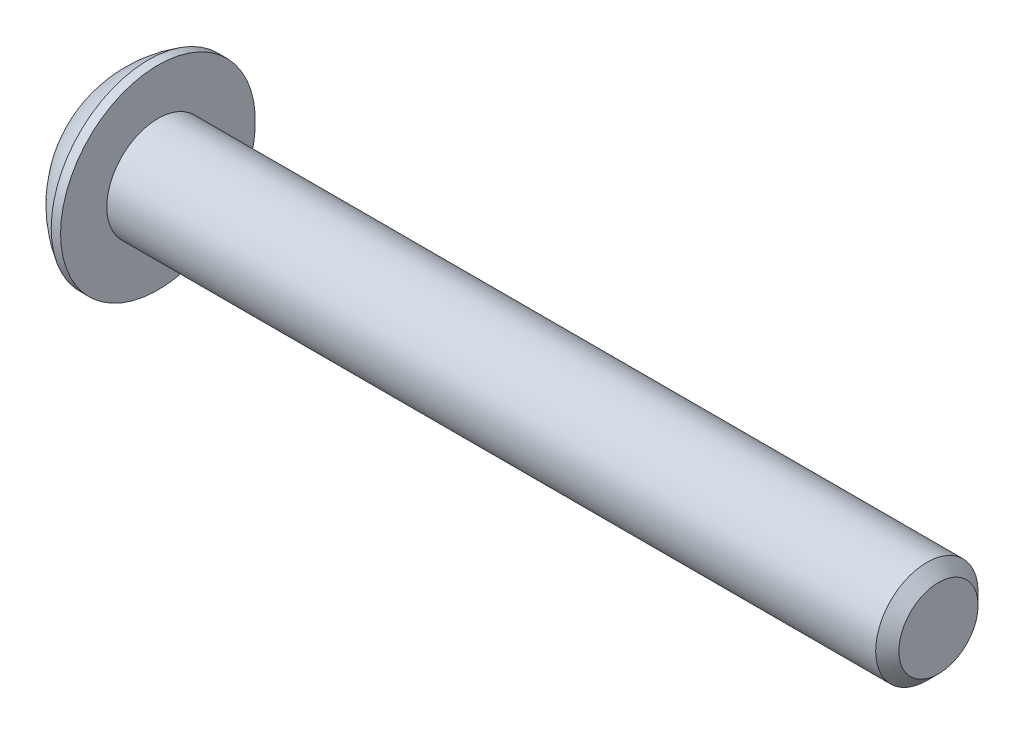
ISO-10303-21;
HEADER;
FILE_DESCRIPTION(('STEP AP214'),'2;1');
FILE_NAME('part.step','',(''),(''),'','','');
FILE_SCHEMA(('AUTOMOTIVE_DESIGN { 1 0 10303 214 1 1 1 1 }'));
ENDSEC;
DATA;
#1=APPLICATION_CONTEXT('core data for automotive mechanical design processes');
#2=APPLICATION_PROTOCOL_DEFINITION('international standard','automotive_design',2000,#1);
#3=PRODUCT_CONTEXT('',#1,'mechanical');
#4=PRODUCT('Part','Part','',(#3));
#5=PRODUCT_RELATED_PRODUCT_CATEGORY('part','',(#4));
#6=PRODUCT_DEFINITION_FORMATION('','',#4);
#7=PRODUCT_DEFINITION_CONTEXT('part definition',#1,'design');
#8=PRODUCT_DEFINITION('design','',#6,#7);
#9=PRODUCT_DEFINITION_SHAPE('','',#8);
#10=(LENGTH_UNIT() NAMED_UNIT(*) SI_UNIT(.MILLI.,.METRE.));
#11=(NAMED_UNIT(*) PLANE_ANGLE_UNIT() SI_UNIT($,.RADIAN.));
#12=(NAMED_UNIT(*) SI_UNIT($,.STERADIAN.) SOLID_ANGLE_UNIT());
#13=UNCERTAINTY_MEASURE_WITH_UNIT(LENGTH_MEASURE(1.E-05),#10,'distance_accuracy_value','');
#14=(GEOMETRIC_REPRESENTATION_CONTEXT(3) GLOBAL_UNCERTAINTY_ASSIGNED_CONTEXT((#13)) GLOBAL_UNIT_ASSIGNED_CONTEXT((#10,
#11,#12)) REPRESENTATION_CONTEXT('',''));
#15=CARTESIAN_POINT('',(0.,0.,0.));
#16=DIRECTION('',(0.,0.,1.));
#17=DIRECTION('',(1.,0.,0.));
#18=AXIS2_PLACEMENT_3D('',#15,#16,#17);
#19=CARTESIAN_POINT('',(1.32079999997359,0.,0.));
#20=DIRECTION('',(-1.,0.,0.));
#21=DIRECTION('',(0.,0.,1.));
#22=AXIS2_PLACEMENT_3D('',#19,#20,#21);
#23=CONICAL_SURFACE('',#22,1.19380000001001,1.04719755119008);
#24=CARTESIAN_POINT('',(2.0100407513155,0.,0.));
#25=VERTEX_POINT('',#24);
#26=VERTEX_LOOP('',#25);
#27=FACE_BOUND('',#26,.T.);
#28=CARTESIAN_POINT('',(1.32079999997359,0.,0.));
#29=DIRECTION('',(-1.,0.,0.));
#30=DIRECTION('',(0.,0.,1.));
#31=AXIS2_PLACEMENT_3D('',#28,#29,#30);
#32=CIRCLE('',#31,1.19380000001001);
#33=CARTESIAN_POINT('',(1.32079999998682,-1.0338611270422,0.596900000002503));
#34=VERTEX_POINT('',#33);
#35=CARTESIAN_POINT('',(1.32079999998682,0.,1.19380000000501));
#36=VERTEX_POINT('',#35);
#37=EDGE_CURVE('E92',#34,#36,#32,.T.);
#38=ORIENTED_EDGE('',*,*,#37,.T.);
#39=CARTESIAN_POINT('',(1.32079999997359,0.,0.));
#40=DIRECTION('',(-1.,0.,0.));
#41=DIRECTION('',(0.,0.,1.));
#42=AXIS2_PLACEMENT_3D('',#39,#40,#41);
#43=CIRCLE('',#42,1.19380000001001);
#44=CARTESIAN_POINT('',(1.32079999998682,1.0338611270422,0.596900000002504));
#45=VERTEX_POINT('',#44);
#46=EDGE_CURVE('E88',#36,#45,#43,.T.);
#47=ORIENTED_EDGE('',*,*,#46,.T.);
#48=CARTESIAN_POINT('',(1.32079999997359,0.,0.));
#49=DIRECTION('',(-1.,0.,0.));
#50=DIRECTION('',(0.,0.,1.));
#51=AXIS2_PLACEMENT_3D('',#48,#49,#50);
#52=CIRCLE('',#51,1.19380000001001);
#53=CARTESIAN_POINT('',(1.32079999998682,1.0338611270422,-0.596900000002504));
#54=VERTEX_POINT('',#53);
#55=EDGE_CURVE('E21',#45,#54,#52,.T.);
#56=ORIENTED_EDGE('',*,*,#55,.T.);
#57=CARTESIAN_POINT('',(1.32079999997359,0.,0.));
#58=DIRECTION('',(-1.,0.,0.));
#59=DIRECTION('',(0.,0.,1.));
#60=AXIS2_PLACEMENT_3D('',#57,#58,#59);
#61=CIRCLE('',#60,1.19380000001001);
#62=CARTESIAN_POINT('',(1.32079999998682,1.49461108489558E-12,-1.19380000000501));
#63=VERTEX_POINT('',#62);
#64=EDGE_CURVE('E151',#54,#63,#61,.T.);
#65=ORIENTED_EDGE('',*,*,#64,.T.);
#66=CARTESIAN_POINT('',(1.32079999997359,0.,0.));
#67=DIRECTION('',(-1.,0.,0.));
#68=DIRECTION('',(0.,0.,1.));
#69=AXIS2_PLACEMENT_3D('',#66,#67,#68);
#70=CIRCLE('',#69,1.19380000001001);
#71=CARTESIAN_POINT('',(1.32079999998682,-1.0338611270422,-0.596900000002503));
#72=VERTEX_POINT('',#71);
#73=EDGE_CURVE('E153',#63,#72,#70,.T.);
#74=ORIENTED_EDGE('',*,*,#73,.T.);
#75=CARTESIAN_POINT('',(1.32079999997359,0.,0.));
#76=DIRECTION('',(-1.,0.,0.));
#77=DIRECTION('',(0.,0.,1.));
#78=AXIS2_PLACEMENT_3D('',#75,#76,#77);
#79=CIRCLE('',#78,1.19380000001001);
#80=EDGE_CURVE('E155',#72,#34,#79,.T.);
#81=ORIENTED_EDGE('',*,*,#80,.T.);
#82=EDGE_LOOP('',(#38,#47,#56,#65,#74,#81));
#83=FACE_BOUND('',#82,.T.);
#84=ADVANCED_FACE('F17',(#27,#83),#23,.F.);
#85=CARTESIAN_POINT('',(1.3208,-2.06772225407572,-1.1938));
#86=DIRECTION('',(1.,0.,0.));
#87=DIRECTION('',(0.,0.,-1.));
#88=AXIS2_PLACEMENT_3D('',#85,#86,#87);
#89=PLANE('',#88);
#90=DIRECTION('',(0.,-0.5,-0.866025403784439));
#91=VECTOR('',#90,1.);
#92=CARTESIAN_POINT('',(1.32080000000004,1.37848150271715,0.));
#93=LINE('',#92,#91);
#94=CARTESIAN_POINT('',(1.32080000000001,1.37848150271715,0.));
#95=VERTEX_POINT('',#94);
#96=EDGE_CURVE('E104',#54,#95,#93,.F.);
#97=ORIENTED_EDGE('',*,*,#96,.F.);
#98=ORIENTED_EDGE('',*,*,#55,.F.);
#99=DIRECTION('',(0.,0.5,-0.866025403784439));
#100=VECTOR('',#99,1.);
#101=CARTESIAN_POINT('',(1.3208,0.689240751358576,1.1938));
#102=LINE('',#101,#100);
#103=EDGE_CURVE('E102',#95,#45,#102,.F.);
#104=ORIENTED_EDGE('',*,*,#103,.F.);
#105=EDGE_LOOP('',(#97,#98,#104));
#106=FACE_BOUND('',#105,.T.);
#107=ADVANCED_FACE('F100',(#106),#89,.F.);
#108=CARTESIAN_POINT('',(1.3208,-2.06772225407572,-1.1938));
#109=DIRECTION('',(1.,0.,0.));
#110=DIRECTION('',(0.,0.,-1.));
#111=AXIS2_PLACEMENT_3D('',#108,#109,#110);
#112=PLANE('',#111);
#113=DIRECTION('',(0.,0.5,-0.866025403784439));
#114=VECTOR('',#113,1.);
#115=CARTESIAN_POINT('',(1.32080000000004,0.689240751358576,1.1938));
#116=LINE('',#115,#114);
#117=CARTESIAN_POINT('',(1.32080000000001,0.689240751358576,1.1938));
#118=VERTEX_POINT('',#117);
#119=EDGE_CURVE('E106',#45,#118,#116,.F.);
#120=ORIENTED_EDGE('',*,*,#119,.F.);
#121=ORIENTED_EDGE('',*,*,#46,.F.);
#122=DIRECTION('',(0.,1.,0.));
#123=VECTOR('',#122,1.);
#124=CARTESIAN_POINT('',(1.3208,-0.689240751358574,1.1938));
#125=LINE('',#124,#123);
#126=EDGE_CURVE('E109',#118,#36,#125,.F.);
#127=ORIENTED_EDGE('',*,*,#126,.F.);
#128=EDGE_LOOP('',(#120,#121,#127));
#129=FACE_BOUND('',#128,.T.);
#130=ADVANCED_FACE('F107',(#129),#112,.F.);
#131=CARTESIAN_POINT('',(1.3208,-2.06772225407572,-1.1938));
#132=DIRECTION('',(1.,0.,0.));
#133=DIRECTION('',(0.,0.,-1.));
#134=AXIS2_PLACEMENT_3D('',#131,#132,#133);
#135=PLANE('',#134);
#136=DIRECTION('',(0.,1.,0.));
#137=VECTOR('',#136,1.);
#138=CARTESIAN_POINT('',(1.32080000000004,-0.689240751358574,1.1938));
#139=LINE('',#138,#137);
#140=CARTESIAN_POINT('',(1.32080000000001,-0.689240751358574,1.1938));
#141=VERTEX_POINT('',#140);
#142=EDGE_CURVE('E169',#36,#141,#139,.F.);
#143=ORIENTED_EDGE('',*,*,#142,.F.);
#144=ORIENTED_EDGE('',*,*,#37,.F.);
#145=DIRECTION('',(0.,0.5,0.866025403784439));
#146=VECTOR('',#145,1.);
#147=CARTESIAN_POINT('',(1.3208,-1.37848150271715,0.));
#148=LINE('',#147,#146);
#149=EDGE_CURVE('E167',#141,#34,#148,.F.);
#150=ORIENTED_EDGE('',*,*,#149,.F.);
#151=EDGE_LOOP('',(#143,#144,#150));
#152=FACE_BOUND('',#151,.T.);
#153=ADVANCED_FACE('F165',(#152),#135,.F.);
#154=CARTESIAN_POINT('',(1.3208,-2.06772225407572,-1.1938));
#155=DIRECTION('',(1.,0.,0.));
#156=DIRECTION('',(0.,0.,-1.));
#157=AXIS2_PLACEMENT_3D('',#154,#155,#156);
#158=PLANE('',#157);
#159=DIRECTION('',(0.,0.5,0.866025403784439));
#160=VECTOR('',#159,1.);
#161=CARTESIAN_POINT('',(1.32080000000004,-1.37848150271715,0.));
#162=LINE('',#161,#160);
#163=CARTESIAN_POINT('',(1.32080000000001,-1.37848150271715,0.));
#164=VERTEX_POINT('',#163);
#165=EDGE_CURVE('E170',#34,#164,#162,.F.);
#166=ORIENTED_EDGE('',*,*,#165,.F.);
#167=ORIENTED_EDGE('',*,*,#80,.F.);
#168=DIRECTION('',(0.,-0.5,0.866025403784439));
#169=VECTOR('',#168,1.);
#170=CARTESIAN_POINT('',(1.3208,-0.689240751358574,-1.1938));
#171=LINE('',#170,#169);
#172=EDGE_CURVE('E173',#164,#72,#171,.F.);
#173=ORIENTED_EDGE('',*,*,#172,.F.);
#174=EDGE_LOOP('',(#166,#167,#173));
#175=FACE_BOUND('',#174,.T.);
#176=ADVANCED_FACE('F171',(#175),#158,.F.);
#177=CARTESIAN_POINT('',(1.3208,-2.06772225407572,-1.1938));
#178=DIRECTION('',(1.,0.,0.));
#179=DIRECTION('',(0.,0.,-1.));
#180=AXIS2_PLACEMENT_3D('',#177,#178,#179);
#181=PLANE('',#180);
#182=DIRECTION('',(0.,-0.5,0.866025403784439));
#183=VECTOR('',#182,1.);
#184=CARTESIAN_POINT('',(1.32080000000004,-0.689240751358574,-1.1938));
#185=LINE('',#184,#183);
#186=CARTESIAN_POINT('',(1.32080000000001,-0.689240751358574,-1.1938));
#187=VERTEX_POINT('',#186);
#188=EDGE_CURVE('E228',#72,#187,#185,.F.);
#189=ORIENTED_EDGE('',*,*,#188,.F.);
#190=ORIENTED_EDGE('',*,*,#73,.F.);
#191=DIRECTION('',(0.,1.,0.));
#192=VECTOR('',#191,1.);
#193=CARTESIAN_POINT('',(1.3208,0.689240751358577,-1.1938));
#194=LINE('',#193,#192);
#195=EDGE_CURVE('E240',#187,#63,#194,.T.);
#196=ORIENTED_EDGE('',*,*,#195,.F.);
#197=EDGE_LOOP('',(#189,#190,#196));
#198=FACE_BOUND('',#197,.T.);
#199=ADVANCED_FACE('F390',(#198),#181,.F.);
#200=CARTESIAN_POINT('',(1.3208,-2.06772225407572,-1.1938));
#201=DIRECTION('',(1.,0.,0.));
#202=DIRECTION('',(0.,0.,-1.));
#203=AXIS2_PLACEMENT_3D('',#200,#201,#202);
#204=PLANE('',#203);
#205=DIRECTION('',(0.,1.,0.));
#206=VECTOR('',#205,1.);
#207=CARTESIAN_POINT('',(1.32080000000004,0.689240751358577,-1.1938));
#208=LINE('',#207,#206);
#209=CARTESIAN_POINT('',(1.32080000000002,0.689240751358565,-1.19380000000002));
#210=VERTEX_POINT('',#209);
#211=EDGE_CURVE('E248',#63,#210,#208,.T.);
#212=ORIENTED_EDGE('',*,*,#211,.F.);
#213=ORIENTED_EDGE('',*,*,#64,.F.);
#214=DIRECTION('',(0.,-0.5,-0.866025403784439));
#215=VECTOR('',#214,1.);
#216=CARTESIAN_POINT('',(1.3208,1.37848150271715,0.));
#217=LINE('',#216,#215);
#218=EDGE_CURVE('E128',#210,#54,#217,.F.);
#219=ORIENTED_EDGE('',*,*,#218,.F.);
#220=EDGE_LOOP('',(#212,#213,#219));
#221=FACE_BOUND('',#220,.T.);
#222=ADVANCED_FACE('F380',(#221),#204,.F.);
#223=CARTESIAN_POINT('',(1.3208,1.37848150271715,0.));
#224=DIRECTION('',(0.,-0.866025403784439,0.5));
#225=DIRECTION('',(0.,-0.5,-0.866025403784439));
#226=AXIS2_PLACEMENT_3D('',#223,#224,#225);
#227=PLANE('',#226);
#228=ORIENTED_EDGE('',*,*,#96,.T.);
#229=DIRECTION('',(1.,0.,0.));
#230=VECTOR('',#229,1.);
#231=CARTESIAN_POINT('',(1.3208,1.37848150271715,0.));
#232=LINE('',#231,#230);
#233=CARTESIAN_POINT('',(0.,1.37848150271715,0.));
#234=VERTEX_POINT('',#233);
#235=EDGE_CURVE('E116',#234,#95,#232,.T.);
#236=ORIENTED_EDGE('',*,*,#235,.F.);
#237=DIRECTION('',(0.,0.5,0.866025403784439));
#238=VECTOR('',#237,1.);
#239=CARTESIAN_POINT('',(0.,0.689240751358577,-1.1938));
#240=LINE('',#239,#238);
#241=CARTESIAN_POINT('',(0.,0.689240751358577,-1.1938));
#242=VERTEX_POINT('',#241);
#243=EDGE_CURVE('E131',#242,#234,#240,.T.);
#244=ORIENTED_EDGE('',*,*,#243,.F.);
#245=DIRECTION('',(1.,0.,0.));
#246=VECTOR('',#245,1.);
#247=CARTESIAN_POINT('',(1.3208,0.689240751358577,-1.1938));
#248=LINE('',#247,#246);
#249=EDGE_CURVE('E135',#210,#242,#248,.F.);
#250=ORIENTED_EDGE('',*,*,#249,.F.);
#251=ORIENTED_EDGE('',*,*,#218,.T.);
#252=EDGE_LOOP('',(#228,#236,#244,#250,#251));
#253=FACE_BOUND('',#252,.T.);
#254=ADVANCED_FACE('F371',(#253),#227,.T.);
#255=CARTESIAN_POINT('',(1.3208,0.689240751358576,1.1938));
#256=DIRECTION('',(0.,-0.866025403784439,-0.5));
#257=DIRECTION('',(0.,0.5,-0.866025403784439));
#258=AXIS2_PLACEMENT_3D('',#255,#256,#257);
#259=PLANE('',#258);
#260=ORIENTED_EDGE('',*,*,#119,.T.);
#261=DIRECTION('',(1.,0.,0.));
#262=VECTOR('',#261,1.);
#263=CARTESIAN_POINT('',(1.3208,0.689240751358576,1.1938));
#264=LINE('',#263,#262);
#265=CARTESIAN_POINT('',(0.,0.689240751358577,1.1938));
#266=VERTEX_POINT('',#265);
#267=EDGE_CURVE('E112',#266,#118,#264,.T.);
#268=ORIENTED_EDGE('',*,*,#267,.F.);
#269=DIRECTION('',(0.,-0.5,0.866025403784439));
#270=VECTOR('',#269,1.);
#271=CARTESIAN_POINT('',(0.,1.37848150271715,0.));
#272=LINE('',#271,#270);
#273=EDGE_CURVE('E134',#234,#266,#272,.T.);
#274=ORIENTED_EDGE('',*,*,#273,.F.);
#275=ORIENTED_EDGE('',*,*,#235,.T.);
#276=ORIENTED_EDGE('',*,*,#103,.T.);
#277=EDGE_LOOP('',(#260,#268,#274,#275,#276));
#278=FACE_BOUND('',#277,.T.);
#279=ADVANCED_FACE('F114',(#278),#259,.T.);
#280=CARTESIAN_POINT('',(1.3208,-0.689240751358574,1.1938));
#281=DIRECTION('',(0.,0.,-1.));
#282=DIRECTION('',(0.,1.,0.));
#283=AXIS2_PLACEMENT_3D('',#280,#281,#282);
#284=PLANE('',#283);
#285=ORIENTED_EDGE('',*,*,#142,.T.);
#286=DIRECTION('',(1.,0.,0.));
#287=VECTOR('',#286,1.);
#288=CARTESIAN_POINT('',(1.3208,-0.689240751358574,1.1938));
#289=LINE('',#288,#287);
#290=CARTESIAN_POINT('',(0.,-0.689240751358574,1.1938));
#291=VERTEX_POINT('',#290);
#292=EDGE_CURVE('E180',#291,#141,#289,.T.);
#293=ORIENTED_EDGE('',*,*,#292,.F.);
#294=DIRECTION('',(0.,1.,0.));
#295=VECTOR('',#294,1.);
#296=CARTESIAN_POINT('',(0.,0.,1.1938));
#297=LINE('',#296,#295);
#298=EDGE_CURVE('E194',#266,#291,#297,.F.);
#299=ORIENTED_EDGE('',*,*,#298,.F.);
#300=ORIENTED_EDGE('',*,*,#267,.T.);
#301=ORIENTED_EDGE('',*,*,#126,.T.);
#302=EDGE_LOOP('',(#285,#293,#299,#300,#301));
#303=FACE_BOUND('',#302,.T.);
#304=ADVANCED_FACE('F216',(#303),#284,.T.);
#305=CARTESIAN_POINT('',(1.3208,-1.37848150271715,0.));
#306=DIRECTION('',(0.,0.866025403784439,-0.5));
#307=DIRECTION('',(0.,0.5,0.866025403784439));
#308=AXIS2_PLACEMENT_3D('',#305,#306,#307);
#309=PLANE('',#308);
#310=ORIENTED_EDGE('',*,*,#165,.T.);
#311=DIRECTION('',(1.,0.,0.));
#312=VECTOR('',#311,1.);
#313=CARTESIAN_POINT('',(1.3208,-1.37848150271715,0.));
#314=LINE('',#313,#312);
#315=CARTESIAN_POINT('',(0.,-1.37848150271715,0.));
#316=VERTEX_POINT('',#315);
#317=EDGE_CURVE('E176',#316,#164,#314,.T.);
#318=ORIENTED_EDGE('',*,*,#317,.F.);
#319=DIRECTION('',(0.,-0.5,-0.866025403784439));
#320=VECTOR('',#319,1.);
#321=CARTESIAN_POINT('',(0.,-0.689240751358574,1.1938));
#322=LINE('',#321,#320);
#323=EDGE_CURVE('E197',#291,#316,#322,.T.);
#324=ORIENTED_EDGE('',*,*,#323,.F.);
#325=ORIENTED_EDGE('',*,*,#292,.T.);
#326=ORIENTED_EDGE('',*,*,#149,.T.);
#327=EDGE_LOOP('',(#310,#318,#324,#325,#326));
#328=FACE_BOUND('',#327,.T.);
#329=ADVANCED_FACE('F178',(#328),#309,.T.);
#330=CARTESIAN_POINT('',(1.3208,-0.689240751358574,-1.1938));
#331=DIRECTION('',(0.,0.866025403784439,0.5));
#332=DIRECTION('',(0.,-0.5,0.866025403784439));
#333=AXIS2_PLACEMENT_3D('',#330,#331,#332);
#334=PLANE('',#333);
#335=ORIENTED_EDGE('',*,*,#188,.T.);
#336=DIRECTION('',(1.,0.,0.));
#337=VECTOR('',#336,1.);
#338=CARTESIAN_POINT('',(1.3208,-0.689240751358574,-1.1938));
#339=LINE('',#338,#337);
#340=CARTESIAN_POINT('',(0.,-0.689240751358574,-1.1938));
#341=VERTEX_POINT('',#340);
#342=EDGE_CURVE('E36',#341,#187,#339,.T.);
#343=ORIENTED_EDGE('',*,*,#342,.F.);
#344=DIRECTION('',(0.,0.5,-0.866025403784439));
#345=VECTOR('',#344,1.);
#346=CARTESIAN_POINT('',(0.,-1.37848150271715,0.));
#347=LINE('',#346,#345);
#348=EDGE_CURVE('E217',#316,#341,#347,.T.);
#349=ORIENTED_EDGE('',*,*,#348,.F.);
#350=ORIENTED_EDGE('',*,*,#317,.T.);
#351=ORIENTED_EDGE('',*,*,#172,.T.);
#352=EDGE_LOOP('',(#335,#343,#349,#350,#351));
#353=FACE_BOUND('',#352,.T.);
#354=ADVANCED_FACE('F337',(#353),#334,.T.);
#355=CARTESIAN_POINT('',(1.3208,0.689240751358577,-1.1938));
#356=DIRECTION('',(0.,0.,1.));
#357=DIRECTION('',(1.,0.,0.));
#358=AXIS2_PLACEMENT_3D('',#355,#356,#357);
#359=PLANE('',#358);
#360=ORIENTED_EDGE('',*,*,#211,.T.);
#361=ORIENTED_EDGE('',*,*,#249,.T.);
#362=DIRECTION('',(0.,1.,0.));
#363=VECTOR('',#362,1.);
#364=CARTESIAN_POINT('',(0.,0.,-1.1938));
#365=LINE('',#364,#363);
#366=EDGE_CURVE('E150',#341,#242,#365,.T.);
#367=ORIENTED_EDGE('',*,*,#366,.F.);
#368=ORIENTED_EDGE('',*,*,#342,.T.);
#369=ORIENTED_EDGE('',*,*,#195,.T.);
#370=EDGE_LOOP('',(#360,#361,#367,#368,#369));
#371=FACE_BOUND('',#370,.T.);
#372=ADVANCED_FACE('F328',(#371),#359,.T.);
#373=CARTESIAN_POINT('',(0.,0.,0.));
#374=DIRECTION('',(-1.,0.,0.));
#375=DIRECTION('',(0.,0.,1.));
#376=AXIS2_PLACEMENT_3D('',#373,#374,#375);
#377=PLANE('',#376);
#378=CARTESIAN_POINT('',(0.,0.,0.));
#379=DIRECTION('',(-1.,0.,0.));
#380=DIRECTION('',(0.,0.,1.));
#381=AXIS2_PLACEMENT_3D('',#378,#379,#380);
#382=CIRCLE('',#381,1.9812);
#383=CARTESIAN_POINT('',(0.,0.,1.9812));
#384=VERTEX_POINT('',#383);
#385=EDGE_CURVE('E147',#384,#384,#382,.F.);
#386=ORIENTED_EDGE('',*,*,#385,.F.);
#387=EDGE_LOOP('',(#386));
#388=FACE_BOUND('',#387,.T.);
#389=ORIENTED_EDGE('',*,*,#348,.T.);
#390=ORIENTED_EDGE('',*,*,#366,.T.);
#391=ORIENTED_EDGE('',*,*,#243,.T.);
#392=ORIENTED_EDGE('',*,*,#273,.T.);
#393=ORIENTED_EDGE('',*,*,#298,.T.);
#394=ORIENTED_EDGE('',*,*,#323,.T.);
#395=EDGE_LOOP('',(#389,#390,#391,#392,#393,#394));
#396=FACE_BOUND('',#395,.T.);
#397=ADVANCED_FACE('F210',(#388,#396),#377,.T.);
#398=CARTESIAN_POINT('',(4.13385,0.,0.));
#399=DIRECTION('',(0.,1.,0.));
#400=DIRECTION('',(-0.489667403954941,0.,-0.871909303485189));
#401=AXIS2_PLACEMENT_3D('',#398,#399,#400);
#402=SPHERICAL_SURFACE('',#401,4.58408870578439);
#403=CARTESIAN_POINT('',(4.13385,0.,0.));
#404=DIRECTION('',(-1.,0.,0.));
#405=DIRECTION('',(0.,0.,1.));
#406=AXIS2_PLACEMENT_3D('',#403,#404,#405);
#407=SPHERICAL_SURFACE('',#406,4.58408870578439);
#408=ORIENTED_EDGE('',*,*,#385,.T.);
#409=EDGE_LOOP('',(#408));
#410=FACE_BOUND('',#409,.T.);
#411=CARTESIAN_POINT('',(1.8288,0.,0.));
#412=DIRECTION('',(-1.,0.,0.));
#413=DIRECTION('',(0.,0.,1.));
#414=AXIS2_PLACEMENT_3D('',#411,#412,#413);
#415=CIRCLE('',#414,3.9624);
#416=CARTESIAN_POINT('',(1.8288,0.,3.9624));
#417=VERTEX_POINT('',#416);
#418=EDGE_CURVE('E144',#417,#417,#415,.F.);
#419=ORIENTED_EDGE('',*,*,#418,.F.);
#420=EDGE_LOOP('',(#419));
#421=FACE_BOUND('',#420,.T.);
#422=ADVANCED_FACE('F19',(#410,#421),#407,.T.);
#423=CARTESIAN_POINT('',(33.9598,0.,0.));
#424=DIRECTION('',(-1.,0.,0.));
#425=DIRECTION('',(0.,0.,1.));
#426=AXIS2_PLACEMENT_3D('',#423,#424,#425);
#427=PLANE('',#426);
#428=CARTESIAN_POINT('',(33.959799999991,0.,0.));
#429=DIRECTION('',(-1.,0.,0.));
#430=DIRECTION('',(0.,0.,1.));
#431=AXIS2_PLACEMENT_3D('',#428,#429,#430);
#432=CIRCLE('',#431,1.61035999997239);
#433=CARTESIAN_POINT('',(33.959799999991,0.,1.61035999997239));
#434=VERTEX_POINT('',#433);
#435=EDGE_CURVE('E141',#434,#434,#432,.T.);
#436=ORIENTED_EDGE('',*,*,#435,.F.);
#437=EDGE_LOOP('',(#436));
#438=FACE_BOUND('',#437,.T.);
#439=ADVANCED_FACE('F270',(#438),#427,.F.);
#440=CARTESIAN_POINT('',(0.,0.,0.));
#441=DIRECTION('',(-1.,0.,0.));
#442=DIRECTION('',(0.,0.,1.));
#443=AXIS2_PLACEMENT_3D('',#440,#441,#442);
#444=CYLINDRICAL_SURFACE('',#443,3.9624);
#445=ORIENTED_EDGE('',*,*,#418,.T.);
#446=EDGE_LOOP('',(#445));
#447=FACE_BOUND('',#446,.T.);
#448=CARTESIAN_POINT('',(2.2098,0.,0.));
#449=DIRECTION('',(-1.,0.,0.));
#450=DIRECTION('',(0.,0.,1.));
#451=AXIS2_PLACEMENT_3D('',#448,#449,#450);
#452=CIRCLE('',#451,3.9624);
#453=CARTESIAN_POINT('',(2.2098,0.,3.9624));
#454=VERTEX_POINT('',#453);
#455=EDGE_CURVE('E138',#454,#454,#452,.T.);
#456=ORIENTED_EDGE('',*,*,#455,.T.);
#457=EDGE_LOOP('',(#456));
#458=FACE_BOUND('',#457,.T.);
#459=ADVANCED_FACE('F266',(#447,#458),#444,.T.);
#460=CARTESIAN_POINT('',(33.4873600000947,0.,0.));
#461=DIRECTION('',(-1.,0.,0.));
#462=DIRECTION('',(0.,0.,1.));
#463=AXIS2_PLACEMENT_3D('',#460,#461,#462);
#464=CONICAL_SURFACE('',#463,2.08279999986871,0.785398163397448);
#465=CARTESIAN_POINT('',(33.48736,0.,0.));
#466=DIRECTION('',(-1.,0.,0.));
#467=DIRECTION('',(0.,0.,1.));
#468=AXIS2_PLACEMENT_3D('',#465,#466,#467);
#469=CIRCLE('',#468,2.0828);
#470=CARTESIAN_POINT('',(33.48736,0.,2.0828));
#471=VERTEX_POINT('',#470);
#472=EDGE_CURVE('E27',#471,#471,#469,.T.);
#473=ORIENTED_EDGE('',*,*,#472,.F.);
#474=EDGE_LOOP('',(#473));
#475=FACE_BOUND('',#474,.T.);
#476=ORIENTED_EDGE('',*,*,#435,.T.);
#477=EDGE_LOOP('',(#476));
#478=FACE_BOUND('',#477,.T.);
#479=ADVANCED_FACE('F262',(#475,#478),#464,.T.);
#480=CARTESIAN_POINT('',(2.2098,2.0828,0.));
#481=DIRECTION('',(-1.,0.,0.));
#482=DIRECTION('',(0.,0.,1.));
#483=AXIS2_PLACEMENT_3D('',#480,#481,#482);
#484=PLANE('',#483);
#485=ORIENTED_EDGE('',*,*,#455,.F.);
#486=EDGE_LOOP('',(#485));
#487=FACE_BOUND('',#486,.T.);
#488=CARTESIAN_POINT('',(2.2098,0.,0.));
#489=DIRECTION('',(-1.,0.,0.));
#490=DIRECTION('',(0.,0.,1.));
#491=AXIS2_PLACEMENT_3D('',#488,#489,#490);
#492=CIRCLE('',#491,2.0828);
#493=CARTESIAN_POINT('',(2.2098,0.,2.0828));
#494=VERTEX_POINT('',#493);
#495=EDGE_CURVE('E11',#494,#494,#492,.F.);
#496=ORIENTED_EDGE('',*,*,#495,.F.);
#497=EDGE_LOOP('',(#496));
#498=FACE_BOUND('',#497,.T.);
#499=ADVANCED_FACE('F265',(#487,#498),#484,.F.);
#500=CARTESIAN_POINT('',(0.,0.,0.));
#501=DIRECTION('',(-1.,0.,0.));
#502=DIRECTION('',(0.,0.,1.));
#503=AXIS2_PLACEMENT_3D('',#500,#501,#502);
#504=CYLINDRICAL_SURFACE('',#503,2.0828);
#505=ORIENTED_EDGE('',*,*,#495,.T.);
#506=EDGE_LOOP('',(#505));
#507=FACE_BOUND('',#506,.T.);
#508=ORIENTED_EDGE('',*,*,#472,.T.);
#509=EDGE_LOOP('',(#508));
#510=FACE_BOUND('',#509,.T.);
#511=ADVANCED_FACE('F260',(#507,#510),#504,.T.);
#512=CLOSED_SHELL('',(#84,#107,#130,#153,#176,#199,#222,#254,#279,#304,#329,#354,#372,#397,#422,
#439,#459,#479,#499,#511));
#513=MANIFOLD_SOLID_BREP('B1',#512);
#514=ADVANCED_BREP_SHAPE_REPRESENTATION('',(#18,#513),#14);
#515=SHAPE_DEFINITION_REPRESENTATION(#9,#514);
ENDSEC;
END-ISO-10303-21;
